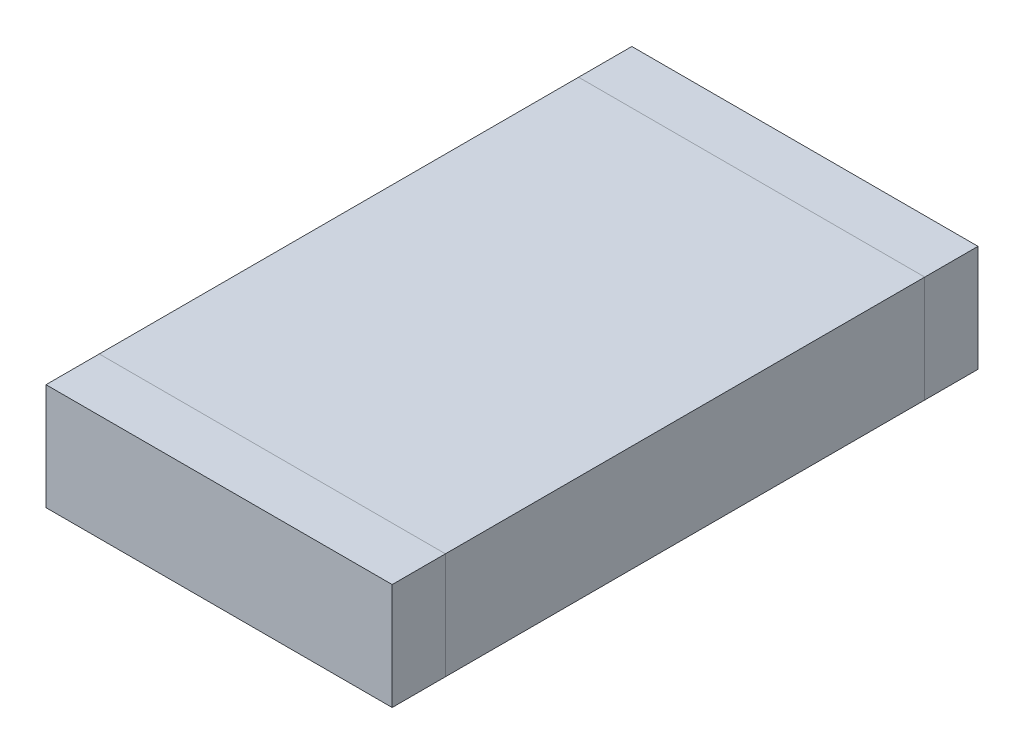
ISO-10303-21;
HEADER;
FILE_DESCRIPTION(('STEP AP214'),'2;1');
FILE_NAME('part.step','',(''),(''),'','','');
FILE_SCHEMA(('AUTOMOTIVE_DESIGN { 1 0 10303 214 1 1 1 1 }'));
ENDSEC;
DATA;
#1=APPLICATION_CONTEXT('core data for automotive mechanical design processes');
#2=APPLICATION_PROTOCOL_DEFINITION('international standard','automotive_design',2000,#1);
#3=PRODUCT_CONTEXT('',#1,'mechanical');
#4=PRODUCT('Part','Part','',(#3));
#5=PRODUCT_RELATED_PRODUCT_CATEGORY('part','',(#4));
#6=PRODUCT_DEFINITION_FORMATION('','',#4);
#7=PRODUCT_DEFINITION_CONTEXT('part definition',#1,'design');
#8=PRODUCT_DEFINITION('design','',#6,#7);
#9=PRODUCT_DEFINITION_SHAPE('','',#8);
#10=(LENGTH_UNIT() NAMED_UNIT(*) SI_UNIT(.MILLI.,.METRE.));
#11=(NAMED_UNIT(*) PLANE_ANGLE_UNIT() SI_UNIT($,.RADIAN.));
#12=(NAMED_UNIT(*) SI_UNIT($,.STERADIAN.) SOLID_ANGLE_UNIT());
#13=UNCERTAINTY_MEASURE_WITH_UNIT(LENGTH_MEASURE(1.E-05),#10,'distance_accuracy_value','');
#14=(GEOMETRIC_REPRESENTATION_CONTEXT(3) GLOBAL_UNCERTAINTY_ASSIGNED_CONTEXT((#13)) GLOBAL_UNIT_ASSIGNED_CONTEXT((#10,
#11,#12)) REPRESENTATION_CONTEXT('',''));
#15=CARTESIAN_POINT('',(0.,0.,0.));
#16=DIRECTION('',(0.,0.,1.));
#17=DIRECTION('',(1.,0.,0.));
#18=AXIS2_PLACEMENT_3D('',#15,#16,#17);
#19=CARTESIAN_POINT('',(0.65,0.4,-1.1));
#20=DIRECTION('',(-1.,0.,0.));
#21=DIRECTION('',(0.,0.,1.));
#22=AXIS2_PLACEMENT_3D('',#19,#20,#21);
#23=PLANE('',#22);
#24=DIRECTION('',(0.,-1.,0.));
#25=VECTOR('',#24,1.);
#26=CARTESIAN_POINT('',(0.65,0.4,-0.9));
#27=LINE('',#26,#25);
#28=CARTESIAN_POINT('',(0.65,0.4,-0.9));
#29=VERTEX_POINT('',#28);
#30=CARTESIAN_POINT('',(0.65,0.,-0.9));
#31=VERTEX_POINT('',#30);
#32=EDGE_CURVE('E107',#29,#31,#27,.T.);
#33=ORIENTED_EDGE('',*,*,#32,.T.);
#34=DIRECTION('',(0.,0.,1.));
#35=VECTOR('',#34,1.);
#36=CARTESIAN_POINT('',(0.65,0.,-1.1));
#37=LINE('',#36,#35);
#38=CARTESIAN_POINT('',(0.65,0.,-1.1));
#39=VERTEX_POINT('',#38);
#40=EDGE_CURVE('E12',#39,#31,#37,.T.);
#41=ORIENTED_EDGE('',*,*,#40,.F.);
#42=DIRECTION('',(0.,-1.,0.));
#43=VECTOR('',#42,1.);
#44=CARTESIAN_POINT('',(0.65,0.4,-1.1));
#45=LINE('',#44,#43);
#46=CARTESIAN_POINT('',(0.65,0.4,-1.1));
#47=VERTEX_POINT('',#46);
#48=EDGE_CURVE('E95',#47,#39,#45,.T.);
#49=ORIENTED_EDGE('',*,*,#48,.F.);
#50=DIRECTION('',(0.,0.,1.));
#51=VECTOR('',#50,1.);
#52=CARTESIAN_POINT('',(0.65,0.4,-1.1));
#53=LINE('',#52,#51);
#54=EDGE_CURVE('E103',#47,#29,#53,.T.);
#55=ORIENTED_EDGE('',*,*,#54,.T.);
#56=EDGE_LOOP('',(#33,#41,#49,#55));
#57=FACE_BOUND('',#56,.T.);
#58=ADVANCED_FACE('F44',(#57),#23,.F.);
#59=CARTESIAN_POINT('',(0.65,0.,-1.1));
#60=DIRECTION('',(0.,1.,0.));
#61=DIRECTION('',(0.,0.,1.));
#62=AXIS2_PLACEMENT_3D('',#59,#60,#61);
#63=PLANE('',#62);
#64=DIRECTION('',(-1.,0.,0.));
#65=VECTOR('',#64,1.);
#66=CARTESIAN_POINT('',(0.65,0.,-0.9));
#67=LINE('',#66,#65);
#68=CARTESIAN_POINT('',(-0.65,0.,-0.9));
#69=VERTEX_POINT('',#68);
#70=EDGE_CURVE('E99',#31,#69,#67,.T.);
#71=ORIENTED_EDGE('',*,*,#70,.T.);
#72=DIRECTION('',(0.,0.,1.));
#73=VECTOR('',#72,1.);
#74=CARTESIAN_POINT('',(-0.65,0.,-1.1));
#75=LINE('',#74,#73);
#76=CARTESIAN_POINT('',(-0.65,0.,-1.1));
#77=VERTEX_POINT('',#76);
#78=EDGE_CURVE('E52',#77,#69,#75,.T.);
#79=ORIENTED_EDGE('',*,*,#78,.F.);
#80=DIRECTION('',(-1.,0.,0.));
#81=VECTOR('',#80,1.);
#82=CARTESIAN_POINT('',(0.65,0.,-1.1));
#83=LINE('',#82,#81);
#84=EDGE_CURVE('E90',#39,#77,#83,.T.);
#85=ORIENTED_EDGE('',*,*,#84,.F.);
#86=ORIENTED_EDGE('',*,*,#40,.T.);
#87=EDGE_LOOP('',(#71,#79,#85,#86));
#88=FACE_BOUND('',#87,.T.);
#89=ADVANCED_FACE('F98',(#88),#63,.F.);
#90=CARTESIAN_POINT('',(-0.65,0.,-1.1));
#91=DIRECTION('',(1.,0.,0.));
#92=DIRECTION('',(0.,0.,-1.));
#93=AXIS2_PLACEMENT_3D('',#90,#91,#92);
#94=PLANE('',#93);
#95=DIRECTION('',(0.,1.,0.));
#96=VECTOR('',#95,1.);
#97=CARTESIAN_POINT('',(-0.65,0.,-0.9));
#98=LINE('',#97,#96);
#99=CARTESIAN_POINT('',(-0.65,0.4,-0.9));
#100=VERTEX_POINT('',#99);
#101=EDGE_CURVE('E77',#69,#100,#98,.T.);
#102=ORIENTED_EDGE('',*,*,#101,.T.);
#103=DIRECTION('',(0.,0.,1.));
#104=VECTOR('',#103,1.);
#105=CARTESIAN_POINT('',(-0.65,0.4,-1.1));
#106=LINE('',#105,#104);
#107=CARTESIAN_POINT('',(-0.65,0.4,-1.1));
#108=VERTEX_POINT('',#107);
#109=EDGE_CURVE('E100',#108,#100,#106,.T.);
#110=ORIENTED_EDGE('',*,*,#109,.F.);
#111=DIRECTION('',(0.,1.,0.));
#112=VECTOR('',#111,1.);
#113=CARTESIAN_POINT('',(-0.65,0.,-1.1));
#114=LINE('',#113,#112);
#115=EDGE_CURVE('E93',#77,#108,#114,.T.);
#116=ORIENTED_EDGE('',*,*,#115,.F.);
#117=ORIENTED_EDGE('',*,*,#78,.T.);
#118=EDGE_LOOP('',(#102,#110,#116,#117));
#119=FACE_BOUND('',#118,.T.);
#120=ADVANCED_FACE('F101',(#119),#94,.F.);
#121=CARTESIAN_POINT('',(-0.65,0.4,-1.1));
#122=DIRECTION('',(0.,-1.,0.));
#123=DIRECTION('',(0.,0.,-1.));
#124=AXIS2_PLACEMENT_3D('',#121,#122,#123);
#125=PLANE('',#124);
#126=DIRECTION('',(1.,0.,0.));
#127=VECTOR('',#126,1.);
#128=CARTESIAN_POINT('',(-0.65,0.4,-0.9));
#129=LINE('',#128,#127);
#130=EDGE_CURVE('E83',#100,#29,#129,.T.);
#131=ORIENTED_EDGE('',*,*,#130,.T.);
#132=ORIENTED_EDGE('',*,*,#54,.F.);
#133=DIRECTION('',(1.,0.,0.));
#134=VECTOR('',#133,1.);
#135=CARTESIAN_POINT('',(-0.65,0.4,-1.1));
#136=LINE('',#135,#134);
#137=EDGE_CURVE('E60',#108,#47,#136,.T.);
#138=ORIENTED_EDGE('',*,*,#137,.F.);
#139=ORIENTED_EDGE('',*,*,#109,.T.);
#140=EDGE_LOOP('',(#131,#132,#138,#139));
#141=FACE_BOUND('',#140,.T.);
#142=ADVANCED_FACE('F114',(#141),#125,.F.);
#143=CARTESIAN_POINT('',(0.,0.,-1.1));
#144=DIRECTION('',(0.,0.,-1.));
#145=DIRECTION('',(-1.,0.,0.));
#146=AXIS2_PLACEMENT_3D('',#143,#144,#145);
#147=PLANE('',#146);
#148=ORIENTED_EDGE('',*,*,#48,.T.);
#149=ORIENTED_EDGE('',*,*,#84,.T.);
#150=ORIENTED_EDGE('',*,*,#115,.T.);
#151=ORIENTED_EDGE('',*,*,#137,.T.);
#152=EDGE_LOOP('',(#148,#149,#150,#151));
#153=FACE_BOUND('',#152,.T.);
#154=ADVANCED_FACE('F91',(#153),#147,.T.);
#155=CARTESIAN_POINT('',(0.,0.,-0.9));
#156=DIRECTION('',(0.,0.,-1.));
#157=DIRECTION('',(-1.,0.,0.));
#158=AXIS2_PLACEMENT_3D('',#155,#156,#157);
#159=PLANE('',#158);
#160=ORIENTED_EDGE('',*,*,#32,.F.);
#161=ORIENTED_EDGE('',*,*,#130,.F.);
#162=ORIENTED_EDGE('',*,*,#101,.F.);
#163=ORIENTED_EDGE('',*,*,#70,.F.);
#164=EDGE_LOOP('',(#160,#161,#162,#163));
#165=FACE_BOUND('',#164,.T.);
#166=ADVANCED_FACE('F117',(#165),#159,.F.);
#167=CLOSED_SHELL('',(#58,#89,#120,#142,#154,#166));
#168=MANIFOLD_SOLID_BREP('B2',#167);
#169=CARTESIAN_POINT('',(-0.65,0.4,1.1));
#170=DIRECTION('',(1.,0.,0.));
#171=DIRECTION('',(0.,0.,-1.));
#172=AXIS2_PLACEMENT_3D('',#169,#170,#171);
#173=PLANE('',#172);
#174=DIRECTION('',(0.,-1.,0.));
#175=VECTOR('',#174,1.);
#176=CARTESIAN_POINT('',(-0.65,0.4,0.9));
#177=LINE('',#176,#175);
#178=CARTESIAN_POINT('',(-0.65,0.4,0.9));
#179=VERTEX_POINT('',#178);
#180=CARTESIAN_POINT('',(-0.65,0.,0.9));
#181=VERTEX_POINT('',#180);
#182=EDGE_CURVE('E240',#179,#181,#177,.T.);
#183=ORIENTED_EDGE('',*,*,#182,.T.);
#184=DIRECTION('',(0.,0.,-1.));
#185=VECTOR('',#184,1.);
#186=CARTESIAN_POINT('',(-0.65,0.,1.1));
#187=LINE('',#186,#185);
#188=CARTESIAN_POINT('',(-0.65,0.,1.1));
#189=VERTEX_POINT('',#188);
#190=EDGE_CURVE('E42',#189,#181,#187,.T.);
#191=ORIENTED_EDGE('',*,*,#190,.F.);
#192=DIRECTION('',(0.,-1.,0.));
#193=VECTOR('',#192,1.);
#194=CARTESIAN_POINT('',(-0.65,0.4,1.1));
#195=LINE('',#194,#193);
#196=CARTESIAN_POINT('',(-0.65,0.4,1.1));
#197=VERTEX_POINT('',#196);
#198=EDGE_CURVE('E228',#197,#189,#195,.T.);
#199=ORIENTED_EDGE('',*,*,#198,.F.);
#200=DIRECTION('',(0.,0.,-1.));
#201=VECTOR('',#200,1.);
#202=CARTESIAN_POINT('',(-0.65,0.4,1.1));
#203=LINE('',#202,#201);
#204=EDGE_CURVE('E236',#197,#179,#203,.T.);
#205=ORIENTED_EDGE('',*,*,#204,.T.);
#206=EDGE_LOOP('',(#183,#191,#199,#205));
#207=FACE_BOUND('',#206,.T.);
#208=ADVANCED_FACE('F177',(#207),#173,.F.);
#209=CARTESIAN_POINT('',(-0.65,0.,1.1));
#210=DIRECTION('',(0.,1.,0.));
#211=DIRECTION('',(0.,0.,1.));
#212=AXIS2_PLACEMENT_3D('',#209,#210,#211);
#213=PLANE('',#212);
#214=DIRECTION('',(1.,0.,0.));
#215=VECTOR('',#214,1.);
#216=CARTESIAN_POINT('',(-0.65,0.,0.9));
#217=LINE('',#216,#215);
#218=CARTESIAN_POINT('',(0.65,0.,0.9));
#219=VERTEX_POINT('',#218);
#220=EDGE_CURVE('E232',#181,#219,#217,.T.);
#221=ORIENTED_EDGE('',*,*,#220,.T.);
#222=DIRECTION('',(0.,0.,-1.));
#223=VECTOR('',#222,1.);
#224=CARTESIAN_POINT('',(0.65,0.,1.1));
#225=LINE('',#224,#223);
#226=CARTESIAN_POINT('',(0.65,0.,1.1));
#227=VERTEX_POINT('',#226);
#228=EDGE_CURVE('E185',#227,#219,#225,.T.);
#229=ORIENTED_EDGE('',*,*,#228,.F.);
#230=DIRECTION('',(1.,0.,0.));
#231=VECTOR('',#230,1.);
#232=CARTESIAN_POINT('',(-0.65,0.,1.1));
#233=LINE('',#232,#231);
#234=EDGE_CURVE('E223',#189,#227,#233,.T.);
#235=ORIENTED_EDGE('',*,*,#234,.F.);
#236=ORIENTED_EDGE('',*,*,#190,.T.);
#237=EDGE_LOOP('',(#221,#229,#235,#236));
#238=FACE_BOUND('',#237,.T.);
#239=ADVANCED_FACE('F231',(#238),#213,.F.);
#240=CARTESIAN_POINT('',(0.65,0.,1.1));
#241=DIRECTION('',(-1.,0.,0.));
#242=DIRECTION('',(0.,0.,1.));
#243=AXIS2_PLACEMENT_3D('',#240,#241,#242);
#244=PLANE('',#243);
#245=DIRECTION('',(0.,1.,0.));
#246=VECTOR('',#245,1.);
#247=CARTESIAN_POINT('',(0.65,0.,0.9));
#248=LINE('',#247,#246);
#249=CARTESIAN_POINT('',(0.65,0.4,0.9));
#250=VERTEX_POINT('',#249);
#251=EDGE_CURVE('E210',#219,#250,#248,.T.);
#252=ORIENTED_EDGE('',*,*,#251,.T.);
#253=DIRECTION('',(0.,0.,-1.));
#254=VECTOR('',#253,1.);
#255=CARTESIAN_POINT('',(0.65,0.4,1.1));
#256=LINE('',#255,#254);
#257=CARTESIAN_POINT('',(0.65,0.4,1.1));
#258=VERTEX_POINT('',#257);
#259=EDGE_CURVE('E233',#258,#250,#256,.T.);
#260=ORIENTED_EDGE('',*,*,#259,.F.);
#261=DIRECTION('',(0.,1.,0.));
#262=VECTOR('',#261,1.);
#263=CARTESIAN_POINT('',(0.65,0.,1.1));
#264=LINE('',#263,#262);
#265=EDGE_CURVE('E226',#227,#258,#264,.T.);
#266=ORIENTED_EDGE('',*,*,#265,.F.);
#267=ORIENTED_EDGE('',*,*,#228,.T.);
#268=EDGE_LOOP('',(#252,#260,#266,#267));
#269=FACE_BOUND('',#268,.T.);
#270=ADVANCED_FACE('F234',(#269),#244,.F.);
#271=CARTESIAN_POINT('',(0.65,0.4,1.1));
#272=DIRECTION('',(0.,-1.,0.));
#273=DIRECTION('',(0.,0.,-1.));
#274=AXIS2_PLACEMENT_3D('',#271,#272,#273);
#275=PLANE('',#274);
#276=DIRECTION('',(-1.,0.,0.));
#277=VECTOR('',#276,1.);
#278=CARTESIAN_POINT('',(0.65,0.4,0.9));
#279=LINE('',#278,#277);
#280=EDGE_CURVE('E216',#250,#179,#279,.T.);
#281=ORIENTED_EDGE('',*,*,#280,.T.);
#282=ORIENTED_EDGE('',*,*,#204,.F.);
#283=DIRECTION('',(-1.,0.,0.));
#284=VECTOR('',#283,1.);
#285=CARTESIAN_POINT('',(0.65,0.4,1.1));
#286=LINE('',#285,#284);
#287=EDGE_CURVE('E193',#258,#197,#286,.T.);
#288=ORIENTED_EDGE('',*,*,#287,.F.);
#289=ORIENTED_EDGE('',*,*,#259,.T.);
#290=EDGE_LOOP('',(#281,#282,#288,#289));
#291=FACE_BOUND('',#290,.T.);
#292=ADVANCED_FACE('F247',(#291),#275,.F.);
#293=CARTESIAN_POINT('',(0.,0.,1.1));
#294=DIRECTION('',(0.,0.,1.));
#295=DIRECTION('',(1.,0.,0.));
#296=AXIS2_PLACEMENT_3D('',#293,#294,#295);
#297=PLANE('',#296);
#298=ORIENTED_EDGE('',*,*,#198,.T.);
#299=ORIENTED_EDGE('',*,*,#234,.T.);
#300=ORIENTED_EDGE('',*,*,#265,.T.);
#301=ORIENTED_EDGE('',*,*,#287,.T.);
#302=EDGE_LOOP('',(#298,#299,#300,#301));
#303=FACE_BOUND('',#302,.T.);
#304=ADVANCED_FACE('F224',(#303),#297,.T.);
#305=CARTESIAN_POINT('',(0.,0.,0.9));
#306=DIRECTION('',(0.,0.,1.));
#307=DIRECTION('',(1.,0.,0.));
#308=AXIS2_PLACEMENT_3D('',#305,#306,#307);
#309=PLANE('',#308);
#310=ORIENTED_EDGE('',*,*,#182,.F.);
#311=ORIENTED_EDGE('',*,*,#280,.F.);
#312=ORIENTED_EDGE('',*,*,#251,.F.);
#313=ORIENTED_EDGE('',*,*,#220,.F.);
#314=EDGE_LOOP('',(#310,#311,#312,#313));
#315=FACE_BOUND('',#314,.T.);
#316=ADVANCED_FACE('F250',(#315),#309,.F.);
#317=CLOSED_SHELL('',(#208,#239,#270,#292,#304,#316));
#318=MANIFOLD_SOLID_BREP('B6',#317);
#319=CARTESIAN_POINT('',(0.65,0.4,-0.9));
#320=DIRECTION('',(-1.,0.,0.));
#321=DIRECTION('',(0.,0.,1.));
#322=AXIS2_PLACEMENT_3D('',#319,#320,#321);
#323=PLANE('',#322);
#324=DIRECTION('',(0.,0.,-1.));
#325=VECTOR('',#324,1.);
#326=CARTESIAN_POINT('',(0.65,0.,-0.9));
#327=LINE('',#326,#325);
#328=CARTESIAN_POINT('',(0.65,0.,0.9));
#329=VERTEX_POINT('',#328);
#330=CARTESIAN_POINT('',(0.65,0.,-0.9));
#331=VERTEX_POINT('',#330);
#332=EDGE_CURVE('E364',#329,#331,#327,.T.);
#333=ORIENTED_EDGE('',*,*,#332,.T.);
#334=DIRECTION('',(0.,-1.,0.));
#335=VECTOR('',#334,1.);
#336=CARTESIAN_POINT('',(0.65,0.4,-0.9));
#337=LINE('',#336,#335);
#338=CARTESIAN_POINT('',(0.65,0.4,-0.9));
#339=VERTEX_POINT('',#338);
#340=EDGE_CURVE('E175',#339,#331,#337,.T.);
#341=ORIENTED_EDGE('',*,*,#340,.F.);
#342=DIRECTION('',(0.,0.,-1.));
#343=VECTOR('',#342,1.);
#344=CARTESIAN_POINT('',(0.65,0.4,-0.9));
#345=LINE('',#344,#343);
#346=CARTESIAN_POINT('',(0.65,0.4,0.9));
#347=VERTEX_POINT('',#346);
#348=EDGE_CURVE('E352',#347,#339,#345,.T.);
#349=ORIENTED_EDGE('',*,*,#348,.F.);
#350=DIRECTION('',(0.,-1.,0.));
#351=VECTOR('',#350,1.);
#352=CARTESIAN_POINT('',(0.65,0.4,0.9));
#353=LINE('',#352,#351);
#354=EDGE_CURVE('E360',#347,#329,#353,.T.);
#355=ORIENTED_EDGE('',*,*,#354,.T.);
#356=EDGE_LOOP('',(#333,#341,#349,#355));
#357=FACE_BOUND('',#356,.T.);
#358=ADVANCED_FACE('F301',(#357),#323,.F.);
#359=CARTESIAN_POINT('',(-0.65,0.4,-0.9));
#360=DIRECTION('',(0.,0.,1.));
#361=DIRECTION('',(1.,0.,0.));
#362=AXIS2_PLACEMENT_3D('',#359,#360,#361);
#363=PLANE('',#362);
#364=DIRECTION('',(-1.,0.,0.));
#365=VECTOR('',#364,1.);
#366=CARTESIAN_POINT('',(-0.65,0.,-0.9));
#367=LINE('',#366,#365);
#368=CARTESIAN_POINT('',(-0.65,0.,-0.9));
#369=VERTEX_POINT('',#368);
#370=EDGE_CURVE('E356',#331,#369,#367,.T.);
#371=ORIENTED_EDGE('',*,*,#370,.T.);
#372=DIRECTION('',(0.,-1.,0.));
#373=VECTOR('',#372,1.);
#374=CARTESIAN_POINT('',(-0.65,0.4,-0.9));
#375=LINE('',#374,#373);
#376=CARTESIAN_POINT('',(-0.65,0.4,-0.9));
#377=VERTEX_POINT('',#376);
#378=EDGE_CURVE('E309',#377,#369,#375,.T.);
#379=ORIENTED_EDGE('',*,*,#378,.F.);
#380=DIRECTION('',(-1.,0.,0.));
#381=VECTOR('',#380,1.);
#382=CARTESIAN_POINT('',(-0.65,0.4,-0.9));
#383=LINE('',#382,#381);
#384=EDGE_CURVE('E347',#339,#377,#383,.T.);
#385=ORIENTED_EDGE('',*,*,#384,.F.);
#386=ORIENTED_EDGE('',*,*,#340,.T.);
#387=EDGE_LOOP('',(#371,#379,#385,#386));
#388=FACE_BOUND('',#387,.T.);
#389=ADVANCED_FACE('F355',(#388),#363,.F.);
#390=CARTESIAN_POINT('',(-0.65,0.4,-0.9));
#391=DIRECTION('',(1.,0.,0.));
#392=DIRECTION('',(0.,0.,-1.));
#393=AXIS2_PLACEMENT_3D('',#390,#391,#392);
#394=PLANE('',#393);
#395=DIRECTION('',(0.,0.,1.));
#396=VECTOR('',#395,1.);
#397=CARTESIAN_POINT('',(-0.65,0.,-0.9));
#398=LINE('',#397,#396);
#399=CARTESIAN_POINT('',(-0.65,0.,0.9));
#400=VERTEX_POINT('',#399);
#401=EDGE_CURVE('E334',#369,#400,#398,.T.);
#402=ORIENTED_EDGE('',*,*,#401,.T.);
#403=DIRECTION('',(0.,-1.,0.));
#404=VECTOR('',#403,1.);
#405=CARTESIAN_POINT('',(-0.65,0.4,0.9));
#406=LINE('',#405,#404);
#407=CARTESIAN_POINT('',(-0.65,0.4,0.9));
#408=VERTEX_POINT('',#407);
#409=EDGE_CURVE('E357',#408,#400,#406,.T.);
#410=ORIENTED_EDGE('',*,*,#409,.F.);
#411=DIRECTION('',(0.,0.,1.));
#412=VECTOR('',#411,1.);
#413=CARTESIAN_POINT('',(-0.65,0.4,-0.9));
#414=LINE('',#413,#412);
#415=EDGE_CURVE('E350',#377,#408,#414,.T.);
#416=ORIENTED_EDGE('',*,*,#415,.F.);
#417=ORIENTED_EDGE('',*,*,#378,.T.);
#418=EDGE_LOOP('',(#402,#410,#416,#417));
#419=FACE_BOUND('',#418,.T.);
#420=ADVANCED_FACE('F358',(#419),#394,.F.);
#421=CARTESIAN_POINT('',(-0.65,0.4,0.9));
#422=DIRECTION('',(0.,0.,-1.));
#423=DIRECTION('',(-1.,0.,0.));
#424=AXIS2_PLACEMENT_3D('',#421,#422,#423);
#425=PLANE('',#424);
#426=DIRECTION('',(1.,0.,0.));
#427=VECTOR('',#426,1.);
#428=CARTESIAN_POINT('',(-0.65,0.,0.9));
#429=LINE('',#428,#427);
#430=EDGE_CURVE('E340',#400,#329,#429,.T.);
#431=ORIENTED_EDGE('',*,*,#430,.T.);
#432=ORIENTED_EDGE('',*,*,#354,.F.);
#433=DIRECTION('',(1.,0.,0.));
#434=VECTOR('',#433,1.);
#435=CARTESIAN_POINT('',(-0.65,0.4,0.9));
#436=LINE('',#435,#434);
#437=EDGE_CURVE('E317',#408,#347,#436,.T.);
#438=ORIENTED_EDGE('',*,*,#437,.F.);
#439=ORIENTED_EDGE('',*,*,#409,.T.);
#440=EDGE_LOOP('',(#431,#432,#438,#439));
#441=FACE_BOUND('',#440,.T.);
#442=ADVANCED_FACE('F371',(#441),#425,.F.);
#443=CARTESIAN_POINT('',(0.,0.4,0.));
#444=DIRECTION('',(0.,1.,0.));
#445=DIRECTION('',(0.,0.,1.));
#446=AXIS2_PLACEMENT_3D('',#443,#444,#445);
#447=PLANE('',#446);
#448=ORIENTED_EDGE('',*,*,#348,.T.);
#449=ORIENTED_EDGE('',*,*,#384,.T.);
#450=ORIENTED_EDGE('',*,*,#415,.T.);
#451=ORIENTED_EDGE('',*,*,#437,.T.);
#452=EDGE_LOOP('',(#448,#449,#450,#451));
#453=FACE_BOUND('',#452,.T.);
#454=ADVANCED_FACE('F348',(#453),#447,.T.);
#455=CARTESIAN_POINT('',(0.,0.,0.));
#456=DIRECTION('',(0.,1.,0.));
#457=DIRECTION('',(0.,0.,1.));
#458=AXIS2_PLACEMENT_3D('',#455,#456,#457);
#459=PLANE('',#458);
#460=ORIENTED_EDGE('',*,*,#332,.F.);
#461=ORIENTED_EDGE('',*,*,#430,.F.);
#462=ORIENTED_EDGE('',*,*,#401,.F.);
#463=ORIENTED_EDGE('',*,*,#370,.F.);
#464=EDGE_LOOP('',(#460,#461,#462,#463));
#465=FACE_BOUND('',#464,.T.);
#466=ADVANCED_FACE('F374',(#465),#459,.F.);
#467=CLOSED_SHELL('',(#358,#389,#420,#442,#454,#466));
#468=MANIFOLD_SOLID_BREP('B36',#467);
#469=ADVANCED_BREP_SHAPE_REPRESENTATION('',(#18,#168,#318,#468),#14);
#470=SHAPE_DEFINITION_REPRESENTATION(#9,#469);
ENDSEC;
END-ISO-10303-21;
